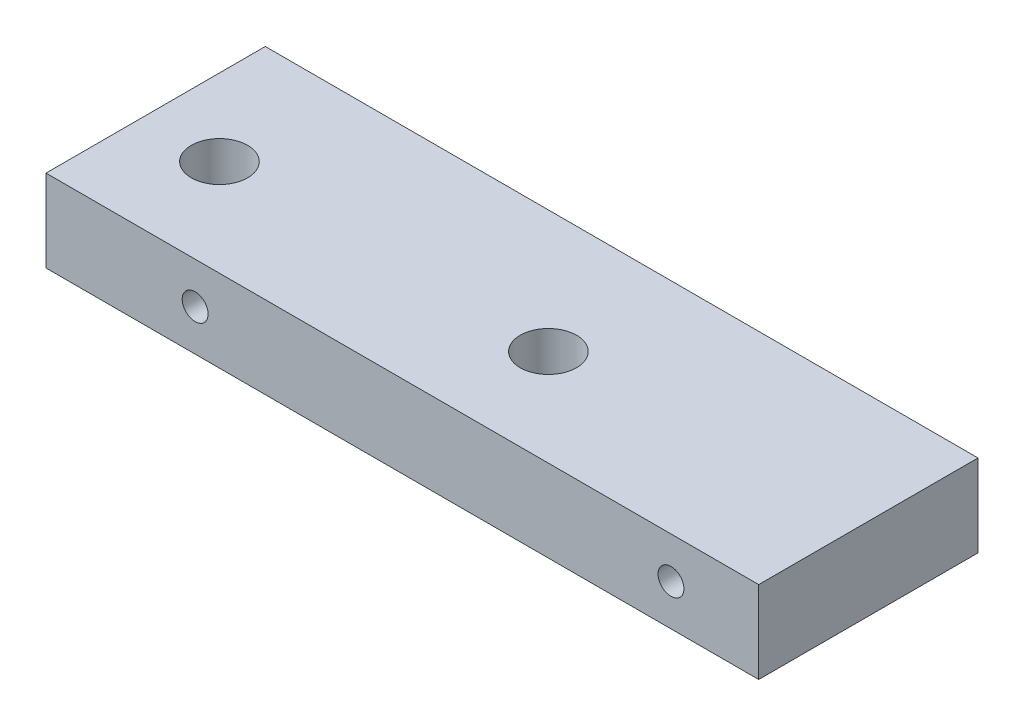
ISO-10303-21;
HEADER;
FILE_DESCRIPTION(('STEP AP214'),'2;1');
FILE_NAME('part.step','',(''),(''),'','','');
FILE_SCHEMA(('AUTOMOTIVE_DESIGN { 1 0 10303 214 1 1 1 1 }'));
ENDSEC;
DATA;
#1=APPLICATION_CONTEXT('core data for automotive mechanical design processes');
#2=APPLICATION_PROTOCOL_DEFINITION('international standard','automotive_design',2000,#1);
#3=PRODUCT_CONTEXT('',#1,'mechanical');
#4=PRODUCT('Part','Part','',(#3));
#5=PRODUCT_RELATED_PRODUCT_CATEGORY('part','',(#4));
#6=PRODUCT_DEFINITION_FORMATION('','',#4);
#7=PRODUCT_DEFINITION_CONTEXT('part definition',#1,'design');
#8=PRODUCT_DEFINITION('design','',#6,#7);
#9=PRODUCT_DEFINITION_SHAPE('','',#8);
#10=(LENGTH_UNIT() NAMED_UNIT(*) SI_UNIT(.MILLI.,.METRE.));
#11=(NAMED_UNIT(*) PLANE_ANGLE_UNIT() SI_UNIT($,.RADIAN.));
#12=(NAMED_UNIT(*) SI_UNIT($,.STERADIAN.) SOLID_ANGLE_UNIT());
#13=UNCERTAINTY_MEASURE_WITH_UNIT(LENGTH_MEASURE(1.E-05),#10,'distance_accuracy_value','');
#14=(GEOMETRIC_REPRESENTATION_CONTEXT(3) GLOBAL_UNCERTAINTY_ASSIGNED_CONTEXT((#13)) GLOBAL_UNIT_ASSIGNED_CONTEXT((#10,
#11,#12)) REPRESENTATION_CONTEXT('',''));
#15=CARTESIAN_POINT('',(0.,0.,0.));
#16=DIRECTION('',(0.,0.,1.));
#17=DIRECTION('',(1.,0.,0.));
#18=AXIS2_PLACEMENT_3D('',#15,#16,#17);
#19=CARTESIAN_POINT('',(0.,9.525,0.));
#20=DIRECTION('',(-1.,0.,0.));
#21=DIRECTION('',(0.,0.,1.));
#22=AXIS2_PLACEMENT_3D('',#19,#20,#21);
#23=PLANE('',#22);
#24=DIRECTION('',(0.,0.,-1.));
#25=VECTOR('',#24,1.);
#26=CARTESIAN_POINT('',(0.,0.,0.));
#27=LINE('',#26,#25);
#28=CARTESIAN_POINT('',(0.,0.,25.4));
#29=VERTEX_POINT('',#28);
#30=CARTESIAN_POINT('',(0.,0.,0.));
#31=VERTEX_POINT('',#30);
#32=EDGE_CURVE('E99',#29,#31,#27,.T.);
#33=ORIENTED_EDGE('',*,*,#32,.T.);
#34=DIRECTION('',(0.,-1.,0.));
#35=VECTOR('',#34,1.);
#36=CARTESIAN_POINT('',(0.,9.525,0.));
#37=LINE('',#36,#35);
#38=CARTESIAN_POINT('',(0.,9.525,0.));
#39=VERTEX_POINT('',#38);
#40=EDGE_CURVE('E11',#39,#31,#37,.T.);
#41=ORIENTED_EDGE('',*,*,#40,.F.);
#42=DIRECTION('',(0.,0.,-1.));
#43=VECTOR('',#42,1.);
#44=CARTESIAN_POINT('',(0.,9.525,0.));
#45=LINE('',#44,#43);
#46=CARTESIAN_POINT('',(0.,9.525,25.4));
#47=VERTEX_POINT('',#46);
#48=EDGE_CURVE('E87',#47,#39,#45,.T.);
#49=ORIENTED_EDGE('',*,*,#48,.F.);
#50=DIRECTION('',(0.,-1.,0.));
#51=VECTOR('',#50,1.);
#52=CARTESIAN_POINT('',(0.,9.525,25.4));
#53=LINE('',#52,#51);
#54=EDGE_CURVE('E95',#47,#29,#53,.T.);
#55=ORIENTED_EDGE('',*,*,#54,.T.);
#56=EDGE_LOOP('',(#33,#41,#49,#55));
#57=FACE_BOUND('',#56,.T.);
#58=ADVANCED_FACE('F36',(#57),#23,.F.);
#59=CARTESIAN_POINT('',(0.,9.525,0.));
#60=DIRECTION('',(0.,0.,1.));
#61=DIRECTION('',(1.,0.,0.));
#62=AXIS2_PLACEMENT_3D('',#59,#60,#61);
#63=PLANE('',#62);
#64=CARTESIAN_POINT('',(-65.278,4.7625,0.));
#65=DIRECTION('',(0.,0.,1.));
#66=DIRECTION('',(1.,0.,0.));
#67=AXIS2_PLACEMENT_3D('',#64,#65,#66);
#68=CIRCLE('',#67,1.5);
#69=CARTESIAN_POINT('',(-63.778,4.7625,0.));
#70=VERTEX_POINT('',#69);
#71=EDGE_CURVE('E124',#70,#70,#68,.T.);
#72=ORIENTED_EDGE('',*,*,#71,.T.);
#73=EDGE_LOOP('',(#72));
#74=FACE_BOUND('',#73,.T.);
#75=CARTESIAN_POINT('',(-10.16,4.7625,0.));
#76=DIRECTION('',(0.,0.,1.));
#77=DIRECTION('',(1.,0.,0.));
#78=AXIS2_PLACEMENT_3D('',#75,#76,#77);
#79=CIRCLE('',#78,1.5);
#80=CARTESIAN_POINT('',(-8.66,4.7625,0.));
#81=VERTEX_POINT('',#80);
#82=EDGE_CURVE('E128',#81,#81,#79,.T.);
#83=ORIENTED_EDGE('',*,*,#82,.T.);
#84=EDGE_LOOP('',(#83));
#85=FACE_BOUND('',#84,.T.);
#86=DIRECTION('',(-1.,0.,0.));
#87=VECTOR('',#86,1.);
#88=CARTESIAN_POINT('',(0.,0.,0.));
#89=LINE('',#88,#87);
#90=CARTESIAN_POINT('',(-82.55,0.,0.));
#91=VERTEX_POINT('',#90);
#92=EDGE_CURVE('E91',#31,#91,#89,.T.);
#93=ORIENTED_EDGE('',*,*,#92,.T.);
#94=DIRECTION('',(0.,-1.,0.));
#95=VECTOR('',#94,1.);
#96=CARTESIAN_POINT('',(-82.55,9.525,0.));
#97=LINE('',#96,#95);
#98=CARTESIAN_POINT('',(-82.55,9.525,0.));
#99=VERTEX_POINT('',#98);
#100=EDGE_CURVE('E44',#99,#91,#97,.T.);
#101=ORIENTED_EDGE('',*,*,#100,.F.);
#102=DIRECTION('',(-1.,0.,0.));
#103=VECTOR('',#102,1.);
#104=CARTESIAN_POINT('',(0.,9.525,0.));
#105=LINE('',#104,#103);
#106=EDGE_CURVE('E82',#39,#99,#105,.T.);
#107=ORIENTED_EDGE('',*,*,#106,.F.);
#108=ORIENTED_EDGE('',*,*,#40,.T.);
#109=EDGE_LOOP('',(#93,#101,#107,#108));
#110=FACE_BOUND('',#109,.T.);
#111=ADVANCED_FACE('F90',(#74,#85,#110),#63,.F.);
#112=CARTESIAN_POINT('',(-82.55,9.525,0.));
#113=DIRECTION('',(1.,0.,0.));
#114=DIRECTION('',(0.,0.,-1.));
#115=AXIS2_PLACEMENT_3D('',#112,#113,#114);
#116=PLANE('',#115);
#117=DIRECTION('',(0.,0.,1.));
#118=VECTOR('',#117,1.);
#119=CARTESIAN_POINT('',(-82.55,0.,0.));
#120=LINE('',#119,#118);
#121=CARTESIAN_POINT('',(-82.55,0.,25.4));
#122=VERTEX_POINT('',#121);
#123=EDGE_CURVE('E69',#91,#122,#120,.T.);
#124=ORIENTED_EDGE('',*,*,#123,.T.);
#125=DIRECTION('',(0.,-1.,0.));
#126=VECTOR('',#125,1.);
#127=CARTESIAN_POINT('',(-82.55,9.525,25.4));
#128=LINE('',#127,#126);
#129=CARTESIAN_POINT('',(-82.55,9.525,25.4));
#130=VERTEX_POINT('',#129);
#131=EDGE_CURVE('E92',#130,#122,#128,.T.);
#132=ORIENTED_EDGE('',*,*,#131,.F.);
#133=DIRECTION('',(0.,0.,1.));
#134=VECTOR('',#133,1.);
#135=CARTESIAN_POINT('',(-82.55,9.525,0.));
#136=LINE('',#135,#134);
#137=EDGE_CURVE('E85',#99,#130,#136,.T.);
#138=ORIENTED_EDGE('',*,*,#137,.F.);
#139=ORIENTED_EDGE('',*,*,#100,.T.);
#140=EDGE_LOOP('',(#124,#132,#138,#139));
#141=FACE_BOUND('',#140,.T.);
#142=ADVANCED_FACE('F93',(#141),#116,.F.);
#143=CARTESIAN_POINT('',(0.,9.525,25.4));
#144=DIRECTION('',(0.,0.,-1.));
#145=DIRECTION('',(-1.,0.,0.));
#146=AXIS2_PLACEMENT_3D('',#143,#144,#145);
#147=PLANE('',#146);
#148=CARTESIAN_POINT('',(-65.278,4.7625,25.4));
#149=DIRECTION('',(0.,0.,1.));
#150=DIRECTION('',(1.,0.,0.));
#151=AXIS2_PLACEMENT_3D('',#148,#149,#150);
#152=CIRCLE('',#151,1.5);
#153=CARTESIAN_POINT('',(-63.778,4.7625,25.4));
#154=VERTEX_POINT('',#153);
#155=EDGE_CURVE('E131',#154,#154,#152,.T.);
#156=ORIENTED_EDGE('',*,*,#155,.F.);
#157=EDGE_LOOP('',(#156));
#158=FACE_BOUND('',#157,.T.);
#159=CARTESIAN_POINT('',(-10.16,4.7625,25.4));
#160=DIRECTION('',(0.,0.,1.));
#161=DIRECTION('',(1.,0.,0.));
#162=AXIS2_PLACEMENT_3D('',#159,#160,#161);
#163=CIRCLE('',#162,1.5);
#164=CARTESIAN_POINT('',(-8.66,4.7625,25.4));
#165=VERTEX_POINT('',#164);
#166=EDGE_CURVE('E125',#165,#165,#163,.T.);
#167=ORIENTED_EDGE('',*,*,#166,.F.);
#168=EDGE_LOOP('',(#167));
#169=FACE_BOUND('',#168,.T.);
#170=DIRECTION('',(1.,0.,0.));
#171=VECTOR('',#170,1.);
#172=CARTESIAN_POINT('',(0.,0.,25.4));
#173=LINE('',#172,#171);
#174=EDGE_CURVE('E75',#122,#29,#173,.T.);
#175=ORIENTED_EDGE('',*,*,#174,.T.);
#176=ORIENTED_EDGE('',*,*,#54,.F.);
#177=DIRECTION('',(1.,0.,0.));
#178=VECTOR('',#177,1.);
#179=CARTESIAN_POINT('',(0.,9.525,25.4));
#180=LINE('',#179,#178);
#181=EDGE_CURVE('E52',#130,#47,#180,.T.);
#182=ORIENTED_EDGE('',*,*,#181,.F.);
#183=ORIENTED_EDGE('',*,*,#131,.T.);
#184=EDGE_LOOP('',(#175,#176,#182,#183));
#185=FACE_BOUND('',#184,.T.);
#186=ADVANCED_FACE('F107',(#158,#169,#185),#147,.F.);
#187=CARTESIAN_POINT('',(0.,9.525,0.));
#188=DIRECTION('',(0.,-1.,0.));
#189=DIRECTION('',(0.,0.,-1.));
#190=AXIS2_PLACEMENT_3D('',#187,#188,#189);
#191=PLANE('',#190);
#192=CARTESIAN_POINT('',(-73.66,9.525,14.200000048));
#193=DIRECTION('',(0.,1.,0.));
#194=DIRECTION('',(0.,0.,1.));
#195=AXIS2_PLACEMENT_3D('',#192,#193,#194);
#196=CIRCLE('',#195,3.2639);
#197=CARTESIAN_POINT('',(-73.66,9.525,17.463900048));
#198=VERTEX_POINT('',#197);
#199=EDGE_CURVE('E121',#198,#198,#196,.T.);
#200=ORIENTED_EDGE('',*,*,#199,.F.);
#201=EDGE_LOOP('',(#200));
#202=FACE_BOUND('',#201,.T.);
#203=CARTESIAN_POINT('',(-35.56,9.525,14.200000048));
#204=DIRECTION('',(0.,1.,0.));
#205=DIRECTION('',(0.,0.,1.));
#206=AXIS2_PLACEMENT_3D('',#203,#204,#205);
#207=CIRCLE('',#206,3.2639);
#208=CARTESIAN_POINT('',(-35.56,9.525,17.463900048));
#209=VERTEX_POINT('',#208);
#210=EDGE_CURVE('E115',#209,#209,#207,.T.);
#211=ORIENTED_EDGE('',*,*,#210,.F.);
#212=EDGE_LOOP('',(#211));
#213=FACE_BOUND('',#212,.T.);
#214=ORIENTED_EDGE('',*,*,#48,.T.);
#215=ORIENTED_EDGE('',*,*,#106,.T.);
#216=ORIENTED_EDGE('',*,*,#137,.T.);
#217=ORIENTED_EDGE('',*,*,#181,.T.);
#218=EDGE_LOOP('',(#214,#215,#216,#217));
#219=FACE_BOUND('',#218,.T.);
#220=ADVANCED_FACE('F83',(#202,#213,#219),#191,.F.);
#221=CARTESIAN_POINT('',(0.,0.,0.));
#222=DIRECTION('',(0.,-1.,0.));
#223=DIRECTION('',(0.,0.,-1.));
#224=AXIS2_PLACEMENT_3D('',#221,#222,#223);
#225=PLANE('',#224);
#226=CARTESIAN_POINT('',(-73.66,0.,14.200000048));
#227=DIRECTION('',(0.,1.,0.));
#228=DIRECTION('',(0.,0.,1.));
#229=AXIS2_PLACEMENT_3D('',#226,#227,#228);
#230=CIRCLE('',#229,3.2639);
#231=CARTESIAN_POINT('',(-73.66,0.,17.463900048));
#232=VERTEX_POINT('',#231);
#233=EDGE_CURVE('E118',#232,#232,#230,.T.);
#234=ORIENTED_EDGE('',*,*,#233,.T.);
#235=EDGE_LOOP('',(#234));
#236=FACE_BOUND('',#235,.T.);
#237=CARTESIAN_POINT('',(-35.56,0.,14.200000048));
#238=DIRECTION('',(0.,1.,0.));
#239=DIRECTION('',(0.,0.,1.));
#240=AXIS2_PLACEMENT_3D('',#237,#238,#239);
#241=CIRCLE('',#240,3.2639);
#242=CARTESIAN_POINT('',(-35.56,0.,17.463900048));
#243=VERTEX_POINT('',#242);
#244=EDGE_CURVE('E102',#243,#243,#241,.T.);
#245=ORIENTED_EDGE('',*,*,#244,.T.);
#246=EDGE_LOOP('',(#245));
#247=FACE_BOUND('',#246,.T.);
#248=ORIENTED_EDGE('',*,*,#32,.F.);
#249=ORIENTED_EDGE('',*,*,#174,.F.);
#250=ORIENTED_EDGE('',*,*,#123,.F.);
#251=ORIENTED_EDGE('',*,*,#92,.F.);
#252=EDGE_LOOP('',(#248,#249,#250,#251));
#253=FACE_BOUND('',#252,.T.);
#254=ADVANCED_FACE('F110',(#236,#247,#253),#225,.T.);
#255=CARTESIAN_POINT('',(-35.56,9.525,14.200000048));
#256=DIRECTION('',(0.,1.,0.));
#257=DIRECTION('',(0.,0.,1.));
#258=AXIS2_PLACEMENT_3D('',#255,#256,#257);
#259=CYLINDRICAL_SURFACE('',#258,3.2639);
#260=ORIENTED_EDGE('',*,*,#244,.F.);
#261=EDGE_LOOP('',(#260));
#262=FACE_BOUND('',#261,.T.);
#263=ORIENTED_EDGE('',*,*,#210,.T.);
#264=EDGE_LOOP('',(#263));
#265=FACE_BOUND('',#264,.T.);
#266=ADVANCED_FACE('F158',(#262,#265),#259,.F.);
#267=CARTESIAN_POINT('',(-73.66,9.525,14.200000048));
#268=DIRECTION('',(0.,1.,0.));
#269=DIRECTION('',(0.,0.,1.));
#270=AXIS2_PLACEMENT_3D('',#267,#268,#269);
#271=CYLINDRICAL_SURFACE('',#270,3.2639);
#272=ORIENTED_EDGE('',*,*,#233,.F.);
#273=EDGE_LOOP('',(#272));
#274=FACE_BOUND('',#273,.T.);
#275=ORIENTED_EDGE('',*,*,#199,.T.);
#276=EDGE_LOOP('',(#275));
#277=FACE_BOUND('',#276,.T.);
#278=ADVANCED_FACE('F152',(#274,#277),#271,.F.);
#279=CARTESIAN_POINT('',(-10.16,4.7625,0.));
#280=DIRECTION('',(0.,0.,1.));
#281=DIRECTION('',(1.,0.,0.));
#282=AXIS2_PLACEMENT_3D('',#279,#280,#281);
#283=CYLINDRICAL_SURFACE('',#282,1.5);
#284=ORIENTED_EDGE('',*,*,#82,.F.);
#285=EDGE_LOOP('',(#284));
#286=FACE_BOUND('',#285,.T.);
#287=ORIENTED_EDGE('',*,*,#166,.T.);
#288=EDGE_LOOP('',(#287));
#289=FACE_BOUND('',#288,.T.);
#290=ADVANCED_FACE('F142',(#286,#289),#283,.F.);
#291=CARTESIAN_POINT('',(-65.278,4.7625,0.));
#292=DIRECTION('',(0.,0.,1.));
#293=DIRECTION('',(1.,0.,0.));
#294=AXIS2_PLACEMENT_3D('',#291,#292,#293);
#295=CYLINDRICAL_SURFACE('',#294,1.5);
#296=ORIENTED_EDGE('',*,*,#71,.F.);
#297=EDGE_LOOP('',(#296));
#298=FACE_BOUND('',#297,.T.);
#299=ORIENTED_EDGE('',*,*,#155,.T.);
#300=EDGE_LOOP('',(#299));
#301=FACE_BOUND('',#300,.T.);
#302=ADVANCED_FACE('F139',(#298,#301),#295,.F.);
#303=CLOSED_SHELL('',(#58,#111,#142,#186,#220,#254,#266,#278,#290,#302));
#304=MANIFOLD_SOLID_BREP('B2',#303);
#305=ADVANCED_BREP_SHAPE_REPRESENTATION('',(#18,#304),#14);
#306=SHAPE_DEFINITION_REPRESENTATION(#9,#305);
ENDSEC;
END-ISO-10303-21;
